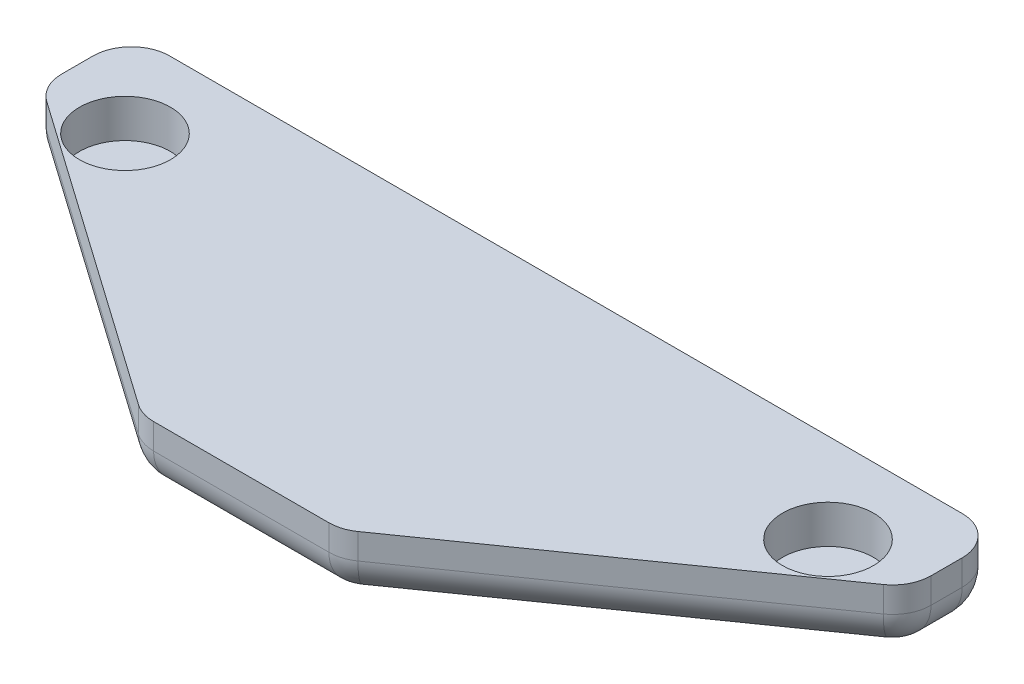
ISO-10303-21;
HEADER;
FILE_DESCRIPTION(('STEP AP214'),'2;1');
FILE_NAME('part.step','',(''),(''),'','','');
FILE_SCHEMA(('AUTOMOTIVE_DESIGN { 1 0 10303 214 1 1 1 1 }'));
ENDSEC;
DATA;
#1=APPLICATION_CONTEXT('core data for automotive mechanical design processes');
#2=APPLICATION_PROTOCOL_DEFINITION('international standard','automotive_design',2000,#1);
#3=PRODUCT_CONTEXT('',#1,'mechanical');
#4=PRODUCT('Part','Part','',(#3));
#5=PRODUCT_RELATED_PRODUCT_CATEGORY('part','',(#4));
#6=PRODUCT_DEFINITION_FORMATION('','',#4);
#7=PRODUCT_DEFINITION_CONTEXT('part definition',#1,'design');
#8=PRODUCT_DEFINITION('design','',#6,#7);
#9=PRODUCT_DEFINITION_SHAPE('','',#8);
#10=(LENGTH_UNIT() NAMED_UNIT(*) SI_UNIT(.MILLI.,.METRE.));
#11=(NAMED_UNIT(*) PLANE_ANGLE_UNIT() SI_UNIT($,.RADIAN.));
#12=(NAMED_UNIT(*) SI_UNIT($,.STERADIAN.) SOLID_ANGLE_UNIT());
#13=UNCERTAINTY_MEASURE_WITH_UNIT(LENGTH_MEASURE(1.E-05),#10,'distance_accuracy_value','');
#14=(GEOMETRIC_REPRESENTATION_CONTEXT(3) GLOBAL_UNCERTAINTY_ASSIGNED_CONTEXT((#13)) GLOBAL_UNIT_ASSIGNED_CONTEXT((#10,
#11,#12)) REPRESENTATION_CONTEXT('',''));
#15=CARTESIAN_POINT('',(0.,0.,0.));
#16=DIRECTION('',(0.,0.,1.));
#17=DIRECTION('',(1.,0.,0.));
#18=AXIS2_PLACEMENT_3D('',#15,#16,#17);
#19=CARTESIAN_POINT('',(-4.21615383625442,2.5,-11.7419034293701));
#20=DIRECTION('',(0.,0.,1.));
#21=DIRECTION('',(1.,0.,0.));
#22=AXIS2_PLACEMENT_3D('',#19,#20,#21);
#23=PLANE('',#22);
#24=DIRECTION('',(-1.,0.,0.));
#25=VECTOR('',#24,1.);
#26=CARTESIAN_POINT('',(-4.21615383625442,1.5,-11.7419034293701));
#27=LINE('',#26,#25);
#28=CARTESIAN_POINT('',(11.2838461637456,1.5,-11.7419034293701));
#29=VERTEX_POINT('',#28);
#30=CARTESIAN_POINT('',(-19.7161538362544,1.5,-11.7419034293701));
#31=VERTEX_POINT('',#30);
#32=EDGE_CURVE('E311',#29,#31,#27,.T.);
#33=ORIENTED_EDGE('',*,*,#32,.T.);
#34=DIRECTION('',(0.,-1.,0.));
#35=VECTOR('',#34,1.);
#36=CARTESIAN_POINT('',(-19.7161538362544,2.5,-11.7419034293701));
#37=LINE('',#36,#35);
#38=CARTESIAN_POINT('',(-19.7161538362544,2.5,-11.7419034293701));
#39=VERTEX_POINT('',#38);
#40=EDGE_CURVE('E314',#31,#39,#37,.F.);
#41=ORIENTED_EDGE('',*,*,#40,.T.);
#42=DIRECTION('',(-1.,0.,0.));
#43=VECTOR('',#42,1.);
#44=CARTESIAN_POINT('',(-4.21615383625442,2.5,-11.7419034293701));
#45=LINE('',#44,#43);
#46=CARTESIAN_POINT('',(11.2838461637456,2.5,-11.7419034293701));
#47=VERTEX_POINT('',#46);
#48=EDGE_CURVE('E266',#47,#39,#45,.T.);
#49=ORIENTED_EDGE('',*,*,#48,.F.);
#50=DIRECTION('',(0.,-1.,0.));
#51=VECTOR('',#50,1.);
#52=CARTESIAN_POINT('',(11.2838461637456,2.5,-11.7419034293701));
#53=LINE('',#52,#51);
#54=EDGE_CURVE('E215',#29,#47,#53,.F.);
#55=ORIENTED_EDGE('',*,*,#54,.F.);
#56=EDGE_LOOP('',(#33,#41,#49,#55));
#57=FACE_BOUND('',#56,.T.);
#58=ADVANCED_FACE('F45',(#57),#23,.F.);
#59=CARTESIAN_POINT('',(-21.2161538362544,2.5,-11.7419034293701));
#60=DIRECTION('',(1.,0.,0.));
#61=DIRECTION('',(0.,0.,-1.));
#62=AXIS2_PLACEMENT_3D('',#59,#60,#61);
#63=PLANE('',#62);
#64=DIRECTION('',(0.,0.,1.));
#65=VECTOR('',#64,1.);
#66=CARTESIAN_POINT('',(-21.2161538362544,1.5,-11.7419034293701));
#67=LINE('',#66,#65);
#68=CARTESIAN_POINT('',(-21.2161538362544,1.5,-10.2419034293701));
#69=VERTEX_POINT('',#68);
#70=CARTESIAN_POINT('',(-21.2161538362544,1.5,-9.02127472491774));
#71=VERTEX_POINT('',#70);
#72=EDGE_CURVE('E302',#69,#71,#67,.T.);
#73=ORIENTED_EDGE('',*,*,#72,.T.);
#74=DIRECTION('',(0.,-1.,0.));
#75=VECTOR('',#74,1.);
#76=CARTESIAN_POINT('',(-21.2161538362544,2.5,-9.02127472491774));
#77=LINE('',#76,#75);
#78=CARTESIAN_POINT('',(-21.2161538362544,2.5,-9.02127472491774));
#79=VERTEX_POINT('',#78);
#80=EDGE_CURVE('E308',#71,#79,#77,.F.);
#81=ORIENTED_EDGE('',*,*,#80,.T.);
#82=DIRECTION('',(0.,0.,1.));
#83=VECTOR('',#82,1.);
#84=CARTESIAN_POINT('',(-21.2161538362544,2.5,-11.7419034293701));
#85=LINE('',#84,#83);
#86=CARTESIAN_POINT('',(-21.2161538362544,2.5,-10.2419034293701));
#87=VERTEX_POINT('',#86);
#88=EDGE_CURVE('E274',#87,#79,#85,.T.);
#89=ORIENTED_EDGE('',*,*,#88,.F.);
#90=DIRECTION('',(0.,-1.,0.));
#91=VECTOR('',#90,1.);
#92=CARTESIAN_POINT('',(-21.2161538362544,2.5,-10.2419034293701));
#93=LINE('',#92,#91);
#94=EDGE_CURVE('E305',#87,#69,#93,.T.);
#95=ORIENTED_EDGE('',*,*,#94,.T.);
#96=EDGE_LOOP('',(#73,#81,#89,#95));
#97=FACE_BOUND('',#96,.T.);
#98=ADVANCED_FACE('F368',(#97),#63,.F.);
#99=CARTESIAN_POINT('',(-21.2161538362544,2.5,-8.24190342937014));
#100=DIRECTION('',(0.574847451278391,0.,-0.818260598928445));
#101=DIRECTION('',(-0.818260598928445,0.,-0.574847451278391));
#102=AXIS2_PLACEMENT_3D('',#99,#100,#101);
#103=PLANE('',#102);
#104=DIRECTION('',(0.818260598928445,0.,0.574847451278391));
#105=VECTOR('',#104,1.);
#106=CARTESIAN_POINT('',(-21.2161538362544,1.5,-8.24190342937014));
#107=LINE('',#106,#105);
#108=CARTESIAN_POINT('',(-20.578425013172,1.5,-7.79388382652507));
#109=VERTEX_POINT('',#108);
#110=CARTESIAN_POINT('',(-8.50855252891305,1.5,0.685487469022524));
#111=VERTEX_POINT('',#110);
#112=EDGE_CURVE('E285',#109,#111,#107,.T.);
#113=ORIENTED_EDGE('',*,*,#112,.T.);
#114=DIRECTION('',(0.,-1.,0.));
#115=VECTOR('',#114,1.);
#116=CARTESIAN_POINT('',(-8.50855252891305,2.5,0.685487469022524));
#117=LINE('',#116,#115);
#118=CARTESIAN_POINT('',(-8.50855252891305,2.5,0.685487469022521));
#119=VERTEX_POINT('',#118);
#120=EDGE_CURVE('E291',#111,#119,#117,.F.);
#121=ORIENTED_EDGE('',*,*,#120,.T.);
#122=DIRECTION('',(0.818260598928445,0.,0.574847451278391));
#123=VECTOR('',#122,1.);
#124=CARTESIAN_POINT('',(-21.2161538362544,2.5,-8.24190342937014));
#125=LINE('',#124,#123);
#126=CARTESIAN_POINT('',(-20.578425013172,2.5,-7.79388382652507));
#127=VERTEX_POINT('',#126);
#128=EDGE_CURVE('E165',#127,#119,#125,.T.);
#129=ORIENTED_EDGE('',*,*,#128,.F.);
#130=DIRECTION('',(0.,-1.,0.));
#131=VECTOR('',#130,1.);
#132=CARTESIAN_POINT('',(-20.578425013172,2.5,-7.79388382652507));
#133=LINE('',#132,#131);
#134=EDGE_CURVE('E288',#127,#109,#133,.T.);
#135=ORIENTED_EDGE('',*,*,#134,.T.);
#136=EDGE_LOOP('',(#113,#121,#129,#135));
#137=FACE_BOUND('',#136,.T.);
#138=ADVANCED_FACE('F379',(#137),#103,.F.);
#139=CARTESIAN_POINT('',(-8.12050995125442,2.5,0.958096570629856));
#140=DIRECTION('',(0.,0.,-1.));
#141=DIRECTION('',(-1.,0.,0.));
#142=AXIS2_PLACEMENT_3D('',#139,#140,#141);
#143=PLANE('',#142);
#144=DIRECTION('',(1.,0.,0.));
#145=VECTOR('',#144,1.);
#146=CARTESIAN_POINT('',(-8.12050995125442,2.5,0.958096570629856));
#147=LINE('',#146,#145);
#148=CARTESIAN_POINT('',(-7.64628135199546,2.5,0.958096570629856));
#149=VERTEX_POINT('',#148);
#150=CARTESIAN_POINT('',(-0.786026320513367,2.5,0.958096570629856));
#151=VERTEX_POINT('',#150);
#152=EDGE_CURVE('E149',#149,#151,#147,.T.);
#153=ORIENTED_EDGE('',*,*,#152,.F.);
#154=DIRECTION('',(0.,-1.,0.));
#155=VECTOR('',#154,1.);
#156=CARTESIAN_POINT('',(-7.64628135199546,2.5,0.958096570629856));
#157=LINE('',#156,#155);
#158=CARTESIAN_POINT('',(-7.64628135199546,1.5,0.958096570629856));
#159=VERTEX_POINT('',#158);
#160=EDGE_CURVE('E282',#149,#159,#157,.T.);
#161=ORIENTED_EDGE('',*,*,#160,.T.);
#162=DIRECTION('',(1.,0.,0.));
#163=VECTOR('',#162,1.);
#164=CARTESIAN_POINT('',(-8.12050995125442,1.5,0.958096570629856));
#165=LINE('',#164,#163);
#166=CARTESIAN_POINT('',(-0.786026320513367,1.5,0.958096570629856));
#167=VERTEX_POINT('',#166);
#168=EDGE_CURVE('E164',#159,#167,#165,.T.);
#169=ORIENTED_EDGE('',*,*,#168,.T.);
#170=DIRECTION('',(0.,-1.,0.));
#171=VECTOR('',#170,1.);
#172=CARTESIAN_POINT('',(-0.786026320513367,2.5,0.958096570629856));
#173=LINE('',#172,#171);
#174=EDGE_CURVE('E170',#151,#167,#173,.T.);
#175=ORIENTED_EDGE('',*,*,#174,.F.);
#176=EDGE_LOOP('',(#153,#161,#169,#175));
#177=FACE_BOUND('',#176,.T.);
#178=ADVANCED_FACE('F178',(#177),#143,.F.);
#179=CARTESIAN_POINT('',(0.,2.5,0.));
#180=DIRECTION('',(0.,1.,0.));
#181=DIRECTION('',(0.,0.,1.));
#182=AXIS2_PLACEMENT_3D('',#179,#180,#181);
#183=PLANE('',#182);
#184=CARTESIAN_POINT('',(-17.9661538362544,2.5,-8.24190342937015));
#185=DIRECTION('',(0.,1.,0.));
#186=DIRECTION('',(0.,0.,1.));
#187=AXIS2_PLACEMENT_3D('',#184,#185,#186);
#188=CIRCLE('',#187,1.78);
#189=CARTESIAN_POINT('',(-17.9661538362544,2.5,-6.46190342937015));
#190=VERTEX_POINT('',#189);
#191=EDGE_CURVE('E267',#190,#190,#188,.T.);
#192=ORIENTED_EDGE('',*,*,#191,.F.);
#193=EDGE_LOOP('',(#192));
#194=FACE_BOUND('',#193,.T.);
#195=ORIENTED_EDGE('',*,*,#128,.T.);
#196=CARTESIAN_POINT('',(-7.64628135199546,2.5,-0.541903429370144));
#197=DIRECTION('',(0.,1.,0.));
#198=DIRECTION('',(0.,0.,1.));
#199=AXIS2_PLACEMENT_3D('',#196,#197,#198);
#200=CIRCLE('',#199,1.5);
#201=EDGE_CURVE('E158',#119,#149,#200,.T.);
#202=ORIENTED_EDGE('',*,*,#201,.T.);
#203=ORIENTED_EDGE('',*,*,#152,.T.);
#204=CARTESIAN_POINT('',(-0.786026320513367,2.5,-0.541903429370144));
#205=DIRECTION('',(0.,-1.,0.));
#206=DIRECTION('',(0.,0.,1.));
#207=AXIS2_PLACEMENT_3D('',#204,#205,#206);
#208=CIRCLE('',#207,1.5);
#209=CARTESIAN_POINT('',(0.0762448564042215,2.5,0.685487469022521));
#210=VERTEX_POINT('',#209);
#211=EDGE_CURVE('E155',#210,#151,#208,.T.);
#212=ORIENTED_EDGE('',*,*,#211,.F.);
#213=DIRECTION('',(-0.818260598928445,0.,0.574847451278391));
#214=VECTOR('',#213,1.);
#215=CARTESIAN_POINT('',(12.7838461637456,2.5,-8.24190342937014));
#216=LINE('',#215,#214);
#217=CARTESIAN_POINT('',(12.1461173406632,2.5,-7.79388382652507));
#218=VERTEX_POINT('',#217);
#219=EDGE_CURVE('E183',#218,#210,#216,.T.);
#220=ORIENTED_EDGE('',*,*,#219,.F.);
#221=CARTESIAN_POINT('',(11.2838461637456,2.5,-9.02127472491774));
#222=DIRECTION('',(0.,-1.,0.));
#223=DIRECTION('',(0.,0.,1.));
#224=AXIS2_PLACEMENT_3D('',#221,#222,#223);
#225=CIRCLE('',#224,1.5);
#226=CARTESIAN_POINT('',(12.7838461637456,2.5,-9.02127472491774));
#227=VERTEX_POINT('',#226);
#228=EDGE_CURVE('E176',#227,#218,#225,.T.);
#229=ORIENTED_EDGE('',*,*,#228,.F.);
#230=DIRECTION('',(0.,0.,1.));
#231=VECTOR('',#230,1.);
#232=CARTESIAN_POINT('',(12.7838461637456,2.5,-11.7419034293701));
#233=LINE('',#232,#231);
#234=CARTESIAN_POINT('',(12.7838461637456,2.5,-10.2419034293701));
#235=VERTEX_POINT('',#234);
#236=EDGE_CURVE('E190',#235,#227,#233,.T.);
#237=ORIENTED_EDGE('',*,*,#236,.F.);
#238=CARTESIAN_POINT('',(11.2838461637456,2.5,-10.2419034293701));
#239=DIRECTION('',(0.,-1.,0.));
#240=DIRECTION('',(0.,0.,1.));
#241=AXIS2_PLACEMENT_3D('',#238,#239,#240);
#242=CIRCLE('',#241,1.5);
#243=EDGE_CURVE('E199',#47,#235,#242,.T.);
#244=ORIENTED_EDGE('',*,*,#243,.F.);
#245=ORIENTED_EDGE('',*,*,#48,.T.);
#246=CARTESIAN_POINT('',(-19.7161538362544,2.5,-10.2419034293701));
#247=DIRECTION('',(0.,1.,0.));
#248=DIRECTION('',(0.,0.,1.));
#249=AXIS2_PLACEMENT_3D('',#246,#247,#248);
#250=CIRCLE('',#249,1.5);
#251=EDGE_CURVE('E294',#39,#87,#250,.T.);
#252=ORIENTED_EDGE('',*,*,#251,.T.);
#253=ORIENTED_EDGE('',*,*,#88,.T.);
#254=CARTESIAN_POINT('',(-19.7161538362544,2.5,-9.02127472491774));
#255=DIRECTION('',(0.,1.,0.));
#256=DIRECTION('',(0.,0.,1.));
#257=AXIS2_PLACEMENT_3D('',#254,#255,#256);
#258=CIRCLE('',#257,1.5);
#259=EDGE_CURVE('E297',#79,#127,#258,.T.);
#260=ORIENTED_EDGE('',*,*,#259,.T.);
#261=EDGE_LOOP('',(#195,#202,#203,#212,#220,#229,#237,#244,#245,#252,#253,#260));
#262=FACE_BOUND('',#261,.T.);
#263=CARTESIAN_POINT('',(9.53384616374559,2.5,-8.24190342937015));
#264=DIRECTION('',(0.,-1.,0.));
#265=DIRECTION('',(0.,0.,1.));
#266=AXIS2_PLACEMENT_3D('',#263,#264,#265);
#267=CIRCLE('',#266,1.78);
#268=CARTESIAN_POINT('',(9.53384616374559,2.5,-6.46190342937015));
#269=VERTEX_POINT('',#268);
#270=EDGE_CURVE('E261',#269,#269,#267,.T.);
#271=ORIENTED_EDGE('',*,*,#270,.T.);
#272=EDGE_LOOP('',(#271));
#273=FACE_BOUND('',#272,.T.);
#274=ADVANCED_FACE('F152',(#194,#262,#273),#183,.T.);
#275=CARTESIAN_POINT('',(0.,0.,0.));
#276=DIRECTION('',(0.,1.,0.));
#277=DIRECTION('',(0.,0.,1.));
#278=AXIS2_PLACEMENT_3D('',#275,#276,#277);
#279=PLANE('',#278);
#280=DIRECTION('',(-1.,0.,0.));
#281=VECTOR('',#280,1.);
#282=CARTESIAN_POINT('',(0.,0.,-10.2419034293701));
#283=LINE('',#282,#281);
#284=CARTESIAN_POINT('',(-19.7161538362544,0.,-10.2419034293701));
#285=VERTEX_POINT('',#284);
#286=CARTESIAN_POINT('',(11.2838461637456,0.,-10.2419034293701));
#287=VERTEX_POINT('',#286);
#288=EDGE_CURVE('E317',#285,#287,#283,.F.);
#289=ORIENTED_EDGE('',*,*,#288,.T.);
#290=DIRECTION('',(0.,0.,1.));
#291=VECTOR('',#290,1.);
#292=CARTESIAN_POINT('',(11.2838461637456,0.,0.));
#293=LINE('',#292,#291);
#294=CARTESIAN_POINT('',(11.2838461637456,0.,-9.02127472491774));
#295=VERTEX_POINT('',#294);
#296=EDGE_CURVE('E219',#295,#287,#293,.F.);
#297=ORIENTED_EDGE('',*,*,#296,.F.);
#298=DIRECTION('',(-0.818260598928445,0.,0.574847451278391));
#299=VECTOR('',#298,1.);
#300=CARTESIAN_POINT('',(-6.16049495388638,0.,3.23378808005362));
#301=LINE('',#300,#299);
#302=CARTESIAN_POINT('',(-0.786026320513366,0.,-0.541903429370144));
#303=VERTEX_POINT('',#302);
#304=EDGE_CURVE('E223',#303,#295,#301,.F.);
#305=ORIENTED_EDGE('',*,*,#304,.F.);
#306=DIRECTION('',(1.,0.,0.));
#307=VECTOR('',#306,1.);
#308=CARTESIAN_POINT('',(0.,0.,-0.541903429370144));
#309=LINE('',#308,#307);
#310=CARTESIAN_POINT('',(-7.64628135199546,0.,-0.541903429370144));
#311=VERTEX_POINT('',#310);
#312=EDGE_CURVE('E11',#303,#311,#309,.F.);
#313=ORIENTED_EDGE('',*,*,#312,.T.);
#314=DIRECTION('',(0.818260598928445,0.,0.574847451278391));
#315=VECTOR('',#314,1.);
#316=CARTESIAN_POINT('',(-2.27181271862245,0.,3.23378808005362));
#317=LINE('',#316,#315);
#318=CARTESIAN_POINT('',(-19.7161538362544,0.,-9.02127472491774));
#319=VERTEX_POINT('',#318);
#320=EDGE_CURVE('E55',#311,#319,#317,.F.);
#321=ORIENTED_EDGE('',*,*,#320,.T.);
#322=DIRECTION('',(0.,0.,1.));
#323=VECTOR('',#322,1.);
#324=CARTESIAN_POINT('',(-19.7161538362544,0.,0.));
#325=LINE('',#324,#323);
#326=EDGE_CURVE('E320',#319,#285,#325,.F.);
#327=ORIENTED_EDGE('',*,*,#326,.T.);
#328=EDGE_LOOP('',(#289,#297,#305,#313,#321,#327));
#329=FACE_BOUND('',#328,.T.);
#330=ADVANCED_FACE('F396',(#329),#279,.F.);
#331=CARTESIAN_POINT('',(-17.9661538362544,1.,-8.24190342937015));
#332=DIRECTION('',(0.,1.,0.));
#333=DIRECTION('',(0.,0.,1.));
#334=AXIS2_PLACEMENT_3D('',#331,#332,#333);
#335=CYLINDRICAL_SURFACE('',#334,1.78);
#336=CARTESIAN_POINT('',(-17.9661538362544,1.,-8.24190342937015));
#337=DIRECTION('',(0.,1.,0.));
#338=DIRECTION('',(0.,0.,1.));
#339=AXIS2_PLACEMENT_3D('',#336,#337,#338);
#340=CIRCLE('',#339,1.78);
#341=CARTESIAN_POINT('',(-17.9661538362544,1.,-6.46190342937015));
#342=VERTEX_POINT('',#341);
#343=EDGE_CURVE('E262',#342,#342,#340,.T.);
#344=ORIENTED_EDGE('',*,*,#343,.F.);
#345=EDGE_LOOP('',(#344));
#346=FACE_BOUND('',#345,.T.);
#347=ORIENTED_EDGE('',*,*,#191,.T.);
#348=EDGE_LOOP('',(#347));
#349=FACE_BOUND('',#348,.T.);
#350=ADVANCED_FACE('F503',(#346,#349),#335,.F.);
#351=CARTESIAN_POINT('',(-17.9661538362544,1.,-8.24190342937015));
#352=DIRECTION('',(0.,1.,0.));
#353=DIRECTION('',(0.,0.,1.));
#354=AXIS2_PLACEMENT_3D('',#351,#352,#353);
#355=PLANE('',#354);
#356=ORIENTED_EDGE('',*,*,#343,.T.);
#357=EDGE_LOOP('',(#356));
#358=FACE_BOUND('',#357,.T.);
#359=ADVANCED_FACE('F472',(#358),#355,.T.);
#360=CARTESIAN_POINT('',(-4.21615383625442,1.5,-10.2419034293701));
#361=DIRECTION('',(-1.,0.,0.));
#362=DIRECTION('',(0.,0.,1.));
#363=AXIS2_PLACEMENT_3D('',#360,#361,#362);
#364=CYLINDRICAL_SURFACE('',#363,1.5);
#365=ORIENTED_EDGE('',*,*,#32,.F.);
#366=CARTESIAN_POINT('',(11.2838461637456,1.5,-10.2419034293701));
#367=DIRECTION('',(-1.,0.,0.));
#368=DIRECTION('',(0.,0.,1.));
#369=AXIS2_PLACEMENT_3D('',#366,#367,#368);
#370=CIRCLE('',#369,1.5);
#371=EDGE_CURVE('E257',#29,#287,#370,.T.);
#372=ORIENTED_EDGE('',*,*,#371,.T.);
#373=ORIENTED_EDGE('',*,*,#288,.F.);
#374=CARTESIAN_POINT('',(-19.7161538362544,1.5,-10.2419034293701));
#375=DIRECTION('',(-1.,0.,0.));
#376=DIRECTION('',(0.,0.,1.));
#377=AXIS2_PLACEMENT_3D('',#374,#375,#376);
#378=CIRCLE('',#377,1.5);
#379=EDGE_CURVE('E49',#31,#285,#378,.T.);
#380=ORIENTED_EDGE('',*,*,#379,.F.);
#381=EDGE_LOOP('',(#365,#372,#373,#380));
#382=FACE_BOUND('',#381,.T.);
#383=ADVANCED_FACE('F47',(#382),#364,.T.);
#384=CARTESIAN_POINT('',(-19.7161538362544,2.5,-10.2419034293701));
#385=DIRECTION('',(0.,-1.,0.));
#386=DIRECTION('',(0.,0.,-1.));
#387=AXIS2_PLACEMENT_3D('',#384,#385,#386);
#388=CYLINDRICAL_SURFACE('',#387,1.5);
#389=ORIENTED_EDGE('',*,*,#251,.F.);
#390=ORIENTED_EDGE('',*,*,#40,.F.);
#391=CARTESIAN_POINT('',(-19.7161538362544,1.5,-10.2419034293701));
#392=DIRECTION('',(0.,-1.,0.));
#393=DIRECTION('',(0.,0.,-1.));
#394=AXIS2_PLACEMENT_3D('',#391,#392,#393);
#395=CIRCLE('',#394,1.5);
#396=EDGE_CURVE('E350',#69,#31,#395,.T.);
#397=ORIENTED_EDGE('',*,*,#396,.F.);
#398=ORIENTED_EDGE('',*,*,#94,.F.);
#399=EDGE_LOOP('',(#389,#390,#397,#398));
#400=FACE_BOUND('',#399,.T.);
#401=ADVANCED_FACE('F466',(#400),#388,.T.);
#402=CARTESIAN_POINT('',(-19.7161538362544,1.5,-10.2419034293701));
#403=DIRECTION('',(0.,0.,-1.));
#404=DIRECTION('',(-1.,0.,0.));
#405=AXIS2_PLACEMENT_3D('',#402,#403,#404);
#406=SPHERICAL_SURFACE('',#405,1.5);
#407=ORIENTED_EDGE('',*,*,#396,.T.);
#408=ORIENTED_EDGE('',*,*,#379,.T.);
#409=CARTESIAN_POINT('',(-19.7161538362544,1.5,-10.2419034293701));
#410=DIRECTION('',(0.,0.,-1.));
#411=DIRECTION('',(-1.,0.,0.));
#412=AXIS2_PLACEMENT_3D('',#409,#410,#411);
#413=CIRCLE('',#412,1.5);
#414=EDGE_CURVE('E347',#69,#285,#413,.F.);
#415=ORIENTED_EDGE('',*,*,#414,.F.);
#416=EDGE_LOOP('',(#407,#408,#415));
#417=FACE_BOUND('',#416,.T.);
#418=ADVANCED_FACE('F359',(#417),#406,.T.);
#419=CARTESIAN_POINT('',(-19.7161538362544,1.5,-11.7419034293701));
#420=DIRECTION('',(0.,0.,1.));
#421=DIRECTION('',(1.,0.,0.));
#422=AXIS2_PLACEMENT_3D('',#419,#420,#421);
#423=CYLINDRICAL_SURFACE('',#422,1.5);
#424=ORIENTED_EDGE('',*,*,#414,.T.);
#425=ORIENTED_EDGE('',*,*,#326,.F.);
#426=CARTESIAN_POINT('',(-19.7161538362544,1.5,-9.02127472491774));
#427=DIRECTION('',(0.,0.,1.));
#428=DIRECTION('',(1.,0.,0.));
#429=AXIS2_PLACEMENT_3D('',#426,#427,#428);
#430=CIRCLE('',#429,1.5);
#431=EDGE_CURVE('E343',#71,#319,#430,.T.);
#432=ORIENTED_EDGE('',*,*,#431,.F.);
#433=ORIENTED_EDGE('',*,*,#72,.F.);
#434=EDGE_LOOP('',(#424,#425,#432,#433));
#435=FACE_BOUND('',#434,.T.);
#436=ADVANCED_FACE('F364',(#435),#423,.T.);
#437=CARTESIAN_POINT('',(-19.7161538362544,2.5,-9.02127472491774));
#438=DIRECTION('',(0.,-1.,0.));
#439=DIRECTION('',(0.,0.,-1.));
#440=AXIS2_PLACEMENT_3D('',#437,#438,#439);
#441=CYLINDRICAL_SURFACE('',#440,1.5);
#442=ORIENTED_EDGE('',*,*,#259,.F.);
#443=ORIENTED_EDGE('',*,*,#80,.F.);
#444=CARTESIAN_POINT('',(-19.7161538362544,1.5,-9.02127472491774));
#445=DIRECTION('',(0.,-1.,0.));
#446=DIRECTION('',(0.,0.,-1.));
#447=AXIS2_PLACEMENT_3D('',#444,#445,#446);
#448=CIRCLE('',#447,1.5);
#449=EDGE_CURVE('E339',#109,#71,#448,.T.);
#450=ORIENTED_EDGE('',*,*,#449,.F.);
#451=ORIENTED_EDGE('',*,*,#134,.F.);
#452=EDGE_LOOP('',(#442,#443,#450,#451));
#453=FACE_BOUND('',#452,.T.);
#454=ADVANCED_FACE('F374',(#453),#441,.T.);
#455=CARTESIAN_POINT('',(-19.7161538362544,1.5,-9.02127472491774));
#456=DIRECTION('',(0.,-1.,0.));
#457=DIRECTION('',(0.,0.,-1.));
#458=AXIS2_PLACEMENT_3D('',#455,#456,#457);
#459=SPHERICAL_SURFACE('',#458,1.5);
#460=ORIENTED_EDGE('',*,*,#449,.T.);
#461=ORIENTED_EDGE('',*,*,#431,.T.);
#462=CARTESIAN_POINT('',(-19.7161538362544,1.5,-9.02127472491774));
#463=DIRECTION('',(-0.818260598928445,0.,-0.574847451278391));
#464=DIRECTION('',(-0.574847451278391,0.,0.818260598928445));
#465=AXIS2_PLACEMENT_3D('',#462,#463,#464);
#466=CIRCLE('',#465,1.5);
#467=EDGE_CURVE('E335',#109,#319,#466,.F.);
#468=ORIENTED_EDGE('',*,*,#467,.F.);
#469=EDGE_LOOP('',(#460,#461,#468));
#470=FACE_BOUND('',#469,.T.);
#471=ADVANCED_FACE('F457',(#470),#459,.T.);
#472=CARTESIAN_POINT('',(-8.12050995125442,1.5,-0.541903429370144));
#473=DIRECTION('',(1.,0.,0.));
#474=DIRECTION('',(0.,0.,-1.));
#475=AXIS2_PLACEMENT_3D('',#472,#473,#474);
#476=CYLINDRICAL_SURFACE('',#475,1.5);
#477=ORIENTED_EDGE('',*,*,#312,.F.);
#478=CARTESIAN_POINT('',(-0.786026320513366,1.5,-0.541903429370144));
#479=DIRECTION('',(-1.,0.,0.));
#480=DIRECTION('',(0.,0.,1.));
#481=AXIS2_PLACEMENT_3D('',#478,#479,#480);
#482=CIRCLE('',#481,1.5);
#483=EDGE_CURVE('E235',#303,#167,#482,.T.);
#484=ORIENTED_EDGE('',*,*,#483,.T.);
#485=ORIENTED_EDGE('',*,*,#168,.F.);
#486=CARTESIAN_POINT('',(-7.64628135199546,1.5,-0.541903429370144));
#487=DIRECTION('',(-1.,0.,0.));
#488=DIRECTION('',(0.,0.,1.));
#489=AXIS2_PLACEMENT_3D('',#486,#487,#488);
#490=CIRCLE('',#489,1.5);
#491=EDGE_CURVE('E331',#311,#159,#490,.T.);
#492=ORIENTED_EDGE('',*,*,#491,.F.);
#493=EDGE_LOOP('',(#477,#484,#485,#492));
#494=FACE_BOUND('',#493,.T.);
#495=ADVANCED_FACE('F390',(#494),#476,.T.);
#496=CARTESIAN_POINT('',(-20.3538826593368,1.5,-9.46929432776281));
#497=DIRECTION('',(0.818260598928445,0.,0.574847451278391));
#498=DIRECTION('',(0.574847451278391,0.,-0.818260598928445));
#499=AXIS2_PLACEMENT_3D('',#496,#497,#498);
#500=CYLINDRICAL_SURFACE('',#499,1.5);
#501=ORIENTED_EDGE('',*,*,#467,.T.);
#502=ORIENTED_EDGE('',*,*,#320,.F.);
#503=CARTESIAN_POINT('',(-7.64628135199546,1.5,-0.541903429370144));
#504=DIRECTION('',(0.818260598928445,0.,0.574847451278391));
#505=DIRECTION('',(0.574847451278391,0.,-0.818260598928445));
#506=AXIS2_PLACEMENT_3D('',#503,#504,#505);
#507=CIRCLE('',#506,1.5);
#508=EDGE_CURVE('E327',#111,#311,#507,.T.);
#509=ORIENTED_EDGE('',*,*,#508,.F.);
#510=ORIENTED_EDGE('',*,*,#112,.F.);
#511=EDGE_LOOP('',(#501,#502,#509,#510));
#512=FACE_BOUND('',#511,.T.);
#513=ADVANCED_FACE('F451',(#512),#500,.T.);
#514=CARTESIAN_POINT('',(-7.64628135199546,1.5,-0.541903429370144));
#515=DIRECTION('',(0.,-1.,0.));
#516=DIRECTION('',(1.,0.,0.));
#517=AXIS2_PLACEMENT_3D('',#514,#515,#516);
#518=SPHERICAL_SURFACE('',#517,1.5);
#519=ORIENTED_EDGE('',*,*,#508,.T.);
#520=ORIENTED_EDGE('',*,*,#491,.T.);
#521=CARTESIAN_POINT('',(-7.64628135199546,1.5,-0.541903429370144));
#522=DIRECTION('',(0.,-1.,0.));
#523=DIRECTION('',(0.,0.,-1.));
#524=AXIS2_PLACEMENT_3D('',#521,#522,#523);
#525=CIRCLE('',#524,1.5);
#526=EDGE_CURVE('E227',#111,#159,#525,.F.);
#527=ORIENTED_EDGE('',*,*,#526,.F.);
#528=EDGE_LOOP('',(#519,#520,#527));
#529=FACE_BOUND('',#528,.T.);
#530=ADVANCED_FACE('F387',(#529),#518,.T.);
#531=CARTESIAN_POINT('',(-7.64628135199546,2.5,-0.541903429370144));
#532=DIRECTION('',(0.,-1.,0.));
#533=DIRECTION('',(0.,0.,-1.));
#534=AXIS2_PLACEMENT_3D('',#531,#532,#533);
#535=CYLINDRICAL_SURFACE('',#534,1.5);
#536=ORIENTED_EDGE('',*,*,#201,.F.);
#537=ORIENTED_EDGE('',*,*,#120,.F.);
#538=ORIENTED_EDGE('',*,*,#526,.T.);
#539=ORIENTED_EDGE('',*,*,#160,.F.);
#540=EDGE_LOOP('',(#536,#537,#538,#539));
#541=FACE_BOUND('',#540,.T.);
#542=ADVANCED_FACE('F385',(#541),#535,.T.);
#543=CARTESIAN_POINT('',(12.7838461637456,2.5,-11.7419034293701));
#544=DIRECTION('',(-1.,0.,0.));
#545=DIRECTION('',(0.,0.,-1.));
#546=AXIS2_PLACEMENT_3D('',#543,#544,#545);
#547=PLANE('',#546);
#548=DIRECTION('',(0.,0.,1.));
#549=VECTOR('',#548,1.);
#550=CARTESIAN_POINT('',(12.7838461637456,1.5,-11.7419034293701));
#551=LINE('',#550,#549);
#552=CARTESIAN_POINT('',(12.7838461637456,1.5,-10.2419034293701));
#553=VERTEX_POINT('',#552);
#554=CARTESIAN_POINT('',(12.7838461637456,1.5,-9.02127472491774));
#555=VERTEX_POINT('',#554);
#556=EDGE_CURVE('E175',#553,#555,#551,.T.);
#557=ORIENTED_EDGE('',*,*,#556,.F.);
#558=DIRECTION('',(0.,-1.,0.));
#559=VECTOR('',#558,1.);
#560=CARTESIAN_POINT('',(12.7838461637456,2.5,-10.2419034293701));
#561=LINE('',#560,#559);
#562=EDGE_CURVE('E207',#235,#553,#561,.T.);
#563=ORIENTED_EDGE('',*,*,#562,.F.);
#564=ORIENTED_EDGE('',*,*,#236,.T.);
#565=DIRECTION('',(0.,-1.,0.));
#566=VECTOR('',#565,1.);
#567=CARTESIAN_POINT('',(12.7838461637456,2.5,-9.02127472491774));
#568=LINE('',#567,#566);
#569=EDGE_CURVE('E211',#555,#227,#568,.F.);
#570=ORIENTED_EDGE('',*,*,#569,.F.);
#571=EDGE_LOOP('',(#557,#563,#564,#570));
#572=FACE_BOUND('',#571,.T.);
#573=ADVANCED_FACE('F414',(#572),#547,.F.);
#574=CARTESIAN_POINT('',(12.7838461637456,2.5,-8.24190342937014));
#575=DIRECTION('',(-0.574847451278391,0.,-0.818260598928445));
#576=DIRECTION('',(0.818260598928445,0.,-0.574847451278391));
#577=AXIS2_PLACEMENT_3D('',#574,#575,#576);
#578=PLANE('',#577);
#579=DIRECTION('',(-0.818260598928445,0.,0.574847451278391));
#580=VECTOR('',#579,1.);
#581=CARTESIAN_POINT('',(12.7838461637456,1.5,-8.24190342937014));
#582=LINE('',#581,#580);
#583=CARTESIAN_POINT('',(12.1461173406632,1.5,-7.79388382652507));
#584=VERTEX_POINT('',#583);
#585=CARTESIAN_POINT('',(0.0762448564042197,1.5,0.685487469022524));
#586=VERTEX_POINT('',#585);
#587=EDGE_CURVE('E182',#584,#586,#582,.T.);
#588=ORIENTED_EDGE('',*,*,#587,.F.);
#589=DIRECTION('',(0.,-1.,0.));
#590=VECTOR('',#589,1.);
#591=CARTESIAN_POINT('',(12.1461173406632,2.5,-7.79388382652507));
#592=LINE('',#591,#590);
#593=EDGE_CURVE('E188',#218,#584,#592,.T.);
#594=ORIENTED_EDGE('',*,*,#593,.F.);
#595=ORIENTED_EDGE('',*,*,#219,.T.);
#596=DIRECTION('',(0.,-1.,0.));
#597=VECTOR('',#596,1.);
#598=CARTESIAN_POINT('',(0.0762448564042197,2.5,0.685487469022524));
#599=LINE('',#598,#597);
#600=EDGE_CURVE('E172',#586,#210,#599,.F.);
#601=ORIENTED_EDGE('',*,*,#600,.F.);
#602=EDGE_LOOP('',(#588,#594,#595,#601));
#603=FACE_BOUND('',#602,.T.);
#604=ADVANCED_FACE('F403',(#603),#578,.F.);
#605=CARTESIAN_POINT('',(9.53384616374559,1.,-8.24190342937015));
#606=DIRECTION('',(0.,1.,0.));
#607=DIRECTION('',(0.,0.,1.));
#608=AXIS2_PLACEMENT_3D('',#605,#606,#607);
#609=CYLINDRICAL_SURFACE('',#608,1.78);
#610=CARTESIAN_POINT('',(9.53384616374559,1.,-8.24190342937015));
#611=DIRECTION('',(0.,-1.,0.));
#612=DIRECTION('',(0.,0.,1.));
#613=AXIS2_PLACEMENT_3D('',#610,#611,#612);
#614=CIRCLE('',#613,1.78);
#615=CARTESIAN_POINT('',(9.53384616374559,1.,-6.46190342937015));
#616=VERTEX_POINT('',#615);
#617=EDGE_CURVE('E416',#616,#616,#614,.T.);
#618=ORIENTED_EDGE('',*,*,#617,.T.);
#619=EDGE_LOOP('',(#618));
#620=FACE_BOUND('',#619,.T.);
#621=ORIENTED_EDGE('',*,*,#270,.F.);
#622=EDGE_LOOP('',(#621));
#623=FACE_BOUND('',#622,.T.);
#624=ADVANCED_FACE('F425',(#620,#623),#609,.F.);
#625=CARTESIAN_POINT('',(9.53384616374559,1.,-8.24190342937015));
#626=DIRECTION('',(0.,1.,0.));
#627=DIRECTION('',(0.,0.,1.));
#628=AXIS2_PLACEMENT_3D('',#625,#626,#627);
#629=PLANE('',#628);
#630=ORIENTED_EDGE('',*,*,#617,.F.);
#631=EDGE_LOOP('',(#630));
#632=FACE_BOUND('',#631,.T.);
#633=ADVANCED_FACE('F427',(#632),#629,.T.);
#634=CARTESIAN_POINT('',(11.2838461637456,2.5,-10.2419034293701));
#635=DIRECTION('',(0.,-1.,0.));
#636=DIRECTION('',(0.,0.,-1.));
#637=AXIS2_PLACEMENT_3D('',#634,#635,#636);
#638=CYLINDRICAL_SURFACE('',#637,1.5);
#639=ORIENTED_EDGE('',*,*,#243,.T.);
#640=ORIENTED_EDGE('',*,*,#562,.T.);
#641=CARTESIAN_POINT('',(11.2838461637456,1.5,-10.2419034293701));
#642=DIRECTION('',(0.,1.,0.));
#643=DIRECTION('',(0.,0.,-1.));
#644=AXIS2_PLACEMENT_3D('',#641,#642,#643);
#645=CIRCLE('',#644,1.5);
#646=EDGE_CURVE('E253',#553,#29,#645,.T.);
#647=ORIENTED_EDGE('',*,*,#646,.T.);
#648=ORIENTED_EDGE('',*,*,#54,.T.);
#649=EDGE_LOOP('',(#639,#640,#647,#648));
#650=FACE_BOUND('',#649,.T.);
#651=ADVANCED_FACE('F434',(#650),#638,.T.);
#652=CARTESIAN_POINT('',(11.2838461637456,1.5,-10.2419034293701));
#653=DIRECTION('',(0.,0.,-1.));
#654=DIRECTION('',(1.,0.,0.));
#655=AXIS2_PLACEMENT_3D('',#652,#653,#654);
#656=SPHERICAL_SURFACE('',#655,1.5);
#657=ORIENTED_EDGE('',*,*,#646,.F.);
#658=CARTESIAN_POINT('',(11.2838461637456,1.5,-10.2419034293701));
#659=DIRECTION('',(0.,0.,1.));
#660=DIRECTION('',(1.,0.,0.));
#661=AXIS2_PLACEMENT_3D('',#658,#659,#660);
#662=CIRCLE('',#661,1.5);
#663=EDGE_CURVE('E249',#553,#287,#662,.F.);
#664=ORIENTED_EDGE('',*,*,#663,.T.);
#665=ORIENTED_EDGE('',*,*,#371,.F.);
#666=EDGE_LOOP('',(#657,#664,#665));
#667=FACE_BOUND('',#666,.T.);
#668=ADVANCED_FACE('F480',(#667),#656,.T.);
#669=CARTESIAN_POINT('',(11.2838461637456,1.5,-11.7419034293701));
#670=DIRECTION('',(0.,0.,1.));
#671=DIRECTION('',(-1.,0.,0.));
#672=AXIS2_PLACEMENT_3D('',#669,#670,#671);
#673=CYLINDRICAL_SURFACE('',#672,1.5);
#674=ORIENTED_EDGE('',*,*,#663,.F.);
#675=ORIENTED_EDGE('',*,*,#556,.T.);
#676=CARTESIAN_POINT('',(11.2838461637456,1.5,-9.02127472491774));
#677=DIRECTION('',(0.,0.,-1.));
#678=DIRECTION('',(-1.,0.,0.));
#679=AXIS2_PLACEMENT_3D('',#676,#677,#678);
#680=CIRCLE('',#679,1.5);
#681=EDGE_CURVE('E245',#555,#295,#680,.T.);
#682=ORIENTED_EDGE('',*,*,#681,.T.);
#683=ORIENTED_EDGE('',*,*,#296,.T.);
#684=EDGE_LOOP('',(#674,#675,#682,#683));
#685=FACE_BOUND('',#684,.T.);
#686=ADVANCED_FACE('F482',(#685),#673,.T.);
#687=CARTESIAN_POINT('',(11.2838461637456,2.5,-9.02127472491774));
#688=DIRECTION('',(0.,-1.,0.));
#689=DIRECTION('',(0.,0.,-1.));
#690=AXIS2_PLACEMENT_3D('',#687,#688,#689);
#691=CYLINDRICAL_SURFACE('',#690,1.5);
#692=ORIENTED_EDGE('',*,*,#228,.T.);
#693=ORIENTED_EDGE('',*,*,#593,.T.);
#694=CARTESIAN_POINT('',(11.2838461637456,1.5,-9.02127472491774));
#695=DIRECTION('',(0.,1.,0.));
#696=DIRECTION('',(0.,0.,-1.));
#697=AXIS2_PLACEMENT_3D('',#694,#695,#696);
#698=CIRCLE('',#697,1.5);
#699=EDGE_CURVE('E242',#584,#555,#698,.T.);
#700=ORIENTED_EDGE('',*,*,#699,.T.);
#701=ORIENTED_EDGE('',*,*,#569,.T.);
#702=EDGE_LOOP('',(#692,#693,#700,#701));
#703=FACE_BOUND('',#702,.T.);
#704=ADVANCED_FACE('F410',(#703),#691,.T.);
#705=CARTESIAN_POINT('',(11.2838461637456,1.5,-9.02127472491774));
#706=DIRECTION('',(0.,-1.,0.));
#707=DIRECTION('',(0.,0.,-1.));
#708=AXIS2_PLACEMENT_3D('',#705,#706,#707);
#709=SPHERICAL_SURFACE('',#708,1.5);
#710=ORIENTED_EDGE('',*,*,#699,.F.);
#711=CARTESIAN_POINT('',(11.2838461637456,1.5,-9.02127472491774));
#712=DIRECTION('',(-0.818260598928445,0.,0.574847451278391));
#713=DIRECTION('',(0.574847451278391,0.,0.818260598928445));
#714=AXIS2_PLACEMENT_3D('',#711,#712,#713);
#715=CIRCLE('',#714,1.5);
#716=EDGE_CURVE('E239',#584,#295,#715,.F.);
#717=ORIENTED_EDGE('',*,*,#716,.T.);
#718=ORIENTED_EDGE('',*,*,#681,.F.);
#719=EDGE_LOOP('',(#710,#717,#718));
#720=FACE_BOUND('',#719,.T.);
#721=ADVANCED_FACE('F484',(#720),#709,.T.);
#722=CARTESIAN_POINT('',(11.921574986828,1.5,-9.46929432776281));
#723=DIRECTION('',(-0.818260598928445,0.,0.574847451278391));
#724=DIRECTION('',(-0.574847451278391,0.,-0.818260598928445));
#725=AXIS2_PLACEMENT_3D('',#722,#723,#724);
#726=CYLINDRICAL_SURFACE('',#725,1.5);
#727=ORIENTED_EDGE('',*,*,#716,.F.);
#728=ORIENTED_EDGE('',*,*,#587,.T.);
#729=CARTESIAN_POINT('',(-0.786026320513366,1.5,-0.541903429370144));
#730=DIRECTION('',(0.818260598928445,0.,-0.574847451278391));
#731=DIRECTION('',(-0.574847451278391,0.,-0.818260598928445));
#732=AXIS2_PLACEMENT_3D('',#729,#730,#731);
#733=CIRCLE('',#732,1.5);
#734=EDGE_CURVE('E231',#586,#303,#733,.T.);
#735=ORIENTED_EDGE('',*,*,#734,.T.);
#736=ORIENTED_EDGE('',*,*,#304,.T.);
#737=EDGE_LOOP('',(#727,#728,#735,#736));
#738=FACE_BOUND('',#737,.T.);
#739=ADVANCED_FACE('F398',(#738),#726,.T.);
#740=CARTESIAN_POINT('',(-0.786026320513367,1.5,-0.541903429370144));
#741=DIRECTION('',(0.,-1.,0.));
#742=DIRECTION('',(-1.,0.,0.));
#743=AXIS2_PLACEMENT_3D('',#740,#741,#742);
#744=SPHERICAL_SURFACE('',#743,1.5);
#745=ORIENTED_EDGE('',*,*,#734,.F.);
#746=CARTESIAN_POINT('',(-0.786026320513367,1.5,-0.541903429370144));
#747=DIRECTION('',(0.,1.,0.));
#748=DIRECTION('',(0.,0.,-1.));
#749=AXIS2_PLACEMENT_3D('',#746,#747,#748);
#750=CIRCLE('',#749,1.5);
#751=EDGE_CURVE('E228',#586,#167,#750,.F.);
#752=ORIENTED_EDGE('',*,*,#751,.T.);
#753=ORIENTED_EDGE('',*,*,#483,.F.);
#754=EDGE_LOOP('',(#745,#752,#753));
#755=FACE_BOUND('',#754,.T.);
#756=ADVANCED_FACE('F394',(#755),#744,.T.);
#757=CARTESIAN_POINT('',(-0.786026320513367,2.5,-0.541903429370144));
#758=DIRECTION('',(0.,-1.,0.));
#759=DIRECTION('',(0.,0.,-1.));
#760=AXIS2_PLACEMENT_3D('',#757,#758,#759);
#761=CYLINDRICAL_SURFACE('',#760,1.5);
#762=ORIENTED_EDGE('',*,*,#211,.T.);
#763=ORIENTED_EDGE('',*,*,#174,.T.);
#764=ORIENTED_EDGE('',*,*,#751,.F.);
#765=ORIENTED_EDGE('',*,*,#600,.T.);
#766=EDGE_LOOP('',(#762,#763,#764,#765));
#767=FACE_BOUND('',#766,.T.);
#768=ADVANCED_FACE('F169',(#767),#761,.T.);
#769=CLOSED_SHELL('',(#58,#98,#138,#178,#274,#330,#350,#359,#383,#401,#418,#436,#454,#471,#495,
#513,#530,#542,#573,#604,#624,#633,#651,#668,#686,#704,#721,#739,#756,#768));
#770=MANIFOLD_SOLID_BREP('B2',#769);
#771=ADVANCED_BREP_SHAPE_REPRESENTATION('',(#18,#770),#14);
#772=SHAPE_DEFINITION_REPRESENTATION(#9,#771);
ENDSEC;
END-ISO-10303-21;
